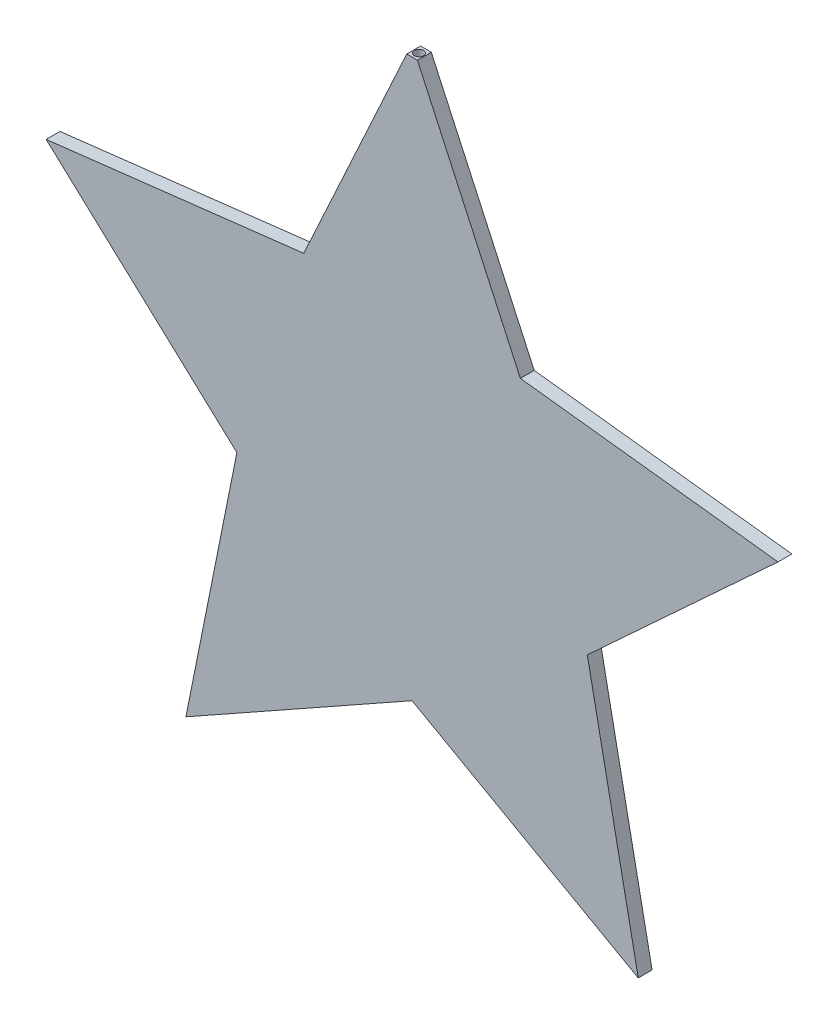
ISO-10303-21;
HEADER;
FILE_DESCRIPTION(('STEP AP214'),'2;1');
FILE_NAME('part.step','',(''),(''),'','','');
FILE_SCHEMA(('AUTOMOTIVE_DESIGN { 1 0 10303 214 1 1 1 1 }'));
ENDSEC;
DATA;
#1=APPLICATION_CONTEXT('core data for automotive mechanical design processes');
#2=APPLICATION_PROTOCOL_DEFINITION('international standard','automotive_design',2000,#1);
#3=PRODUCT_CONTEXT('',#1,'mechanical');
#4=PRODUCT('Part','Part','',(#3));
#5=PRODUCT_RELATED_PRODUCT_CATEGORY('part','',(#4));
#6=PRODUCT_DEFINITION_FORMATION('','',#4);
#7=PRODUCT_DEFINITION_CONTEXT('part definition',#1,'design');
#8=PRODUCT_DEFINITION('design','',#6,#7);
#9=PRODUCT_DEFINITION_SHAPE('','',#8);
#10=(LENGTH_UNIT() NAMED_UNIT(*) SI_UNIT(.MILLI.,.METRE.));
#11=(NAMED_UNIT(*) PLANE_ANGLE_UNIT() SI_UNIT($,.RADIAN.));
#12=(NAMED_UNIT(*) SI_UNIT($,.STERADIAN.) SOLID_ANGLE_UNIT());
#13=UNCERTAINTY_MEASURE_WITH_UNIT(LENGTH_MEASURE(1.E-05),#10,'distance_accuracy_value','');
#14=(GEOMETRIC_REPRESENTATION_CONTEXT(3) GLOBAL_UNCERTAINTY_ASSIGNED_CONTEXT((#13)) GLOBAL_UNIT_ASSIGNED_CONTEXT((#10,
#11,#12)) REPRESENTATION_CONTEXT('',''));
#15=CARTESIAN_POINT('',(0.,0.,0.));
#16=DIRECTION('',(0.,0.,1.));
#17=DIRECTION('',(1.,0.,0.));
#18=AXIS2_PLACEMENT_3D('',#15,#16,#17);
#19=CARTESIAN_POINT('',(-23.4822401036244,99.8205307307917,1.5));
#20=DIRECTION('',(0.116227999491727,-0.99322255921528,0.));
#21=DIRECTION('',(0.99322255921528,0.116227999491727,0.));
#22=AXIS2_PLACEMENT_3D('',#19,#20,#21);
#23=PLANE('',#22);
#24=DIRECTION('',(-0.99322255921528,-0.116227999491727,0.));
#25=VECTOR('',#24,1.);
#26=CARTESIAN_POINT('',(-23.4822401036244,99.8205307307917,-1.5));
#27=LINE('',#26,#25);
#28=CARTESIAN_POINT('',(-23.4822401036244,99.8205307307917,-1.5));
#29=VERTEX_POINT('',#28);
#30=CARTESIAN_POINT('',(-79.3510090594839,93.2827057593821,-1.5));
#31=VERTEX_POINT('',#30);
#32=EDGE_CURVE('E139',#29,#31,#27,.T.);
#33=ORIENTED_EDGE('',*,*,#32,.T.);
#34=DIRECTION('',(0.,0.,-1.));
#35=VECTOR('',#34,1.);
#36=CARTESIAN_POINT('',(-79.3510090594839,93.2827057593821,1.5));
#37=LINE('',#36,#35);
#38=CARTESIAN_POINT('',(-79.3510090594839,93.2827057593821,1.5));
#39=VERTEX_POINT('',#38);
#40=EDGE_CURVE('E11',#39,#31,#37,.T.);
#41=ORIENTED_EDGE('',*,*,#40,.F.);
#42=DIRECTION('',(-0.99322255921528,-0.116227999491727,0.));
#43=VECTOR('',#42,1.);
#44=CARTESIAN_POINT('',(-23.4822401036244,99.8205307307917,1.5));
#45=LINE('',#44,#43);
#46=CARTESIAN_POINT('',(-23.4822401036244,99.8205307307917,1.5));
#47=VERTEX_POINT('',#46);
#48=EDGE_CURVE('E140',#47,#39,#45,.T.);
#49=ORIENTED_EDGE('',*,*,#48,.F.);
#50=DIRECTION('',(0.,0.,-1.));
#51=VECTOR('',#50,1.);
#52=CARTESIAN_POINT('',(-23.4822401036244,99.8205307307917,1.5));
#53=LINE('',#52,#51);
#54=EDGE_CURVE('E150',#47,#29,#53,.T.);
#55=ORIENTED_EDGE('',*,*,#54,.T.);
#56=EDGE_LOOP('',(#33,#41,#49,#55));
#57=FACE_BOUND('',#56,.T.);
#58=ADVANCED_FACE('F32',(#57),#23,.F.);
#59=CARTESIAN_POINT('',(-79.3510090594839,93.2827057593821,1.5));
#60=DIRECTION('',(0.677831999361938,0.735216825597046,0.));
#61=DIRECTION('',(-0.735216825597046,0.677831999361938,0.));
#62=AXIS2_PLACEMENT_3D('',#59,#60,#61);
#63=PLANE('',#62);
#64=DIRECTION('',(0.735216825597046,-0.677831999361938,0.));
#65=VECTOR('',#64,1.);
#66=CARTESIAN_POINT('',(-79.3510090594839,93.2827057593821,-1.5));
#67=LINE('',#66,#65);
#68=CARTESIAN_POINT('',(-37.9950626196501,55.1546557952731,-1.5));
#69=VERTEX_POINT('',#68);
#70=EDGE_CURVE('E182',#31,#69,#67,.T.);
#71=ORIENTED_EDGE('',*,*,#70,.T.);
#72=DIRECTION('',(0.,0.,-1.));
#73=VECTOR('',#72,1.);
#74=CARTESIAN_POINT('',(-37.9950626196501,55.1546557952731,1.5));
#75=LINE('',#74,#73);
#76=CARTESIAN_POINT('',(-37.9950626196501,55.1546557952731,1.5));
#77=VERTEX_POINT('',#76);
#78=EDGE_CURVE('E40',#77,#69,#75,.T.);
#79=ORIENTED_EDGE('',*,*,#78,.F.);
#80=DIRECTION('',(0.735216825597046,-0.677831999361938,0.));
#81=VECTOR('',#80,1.);
#82=CARTESIAN_POINT('',(-79.3510090594839,93.2827057593821,1.5));
#83=LINE('',#82,#81);
#84=EDGE_CURVE('E144',#39,#77,#83,.T.);
#85=ORIENTED_EDGE('',*,*,#84,.F.);
#86=ORIENTED_EDGE('',*,*,#40,.T.);
#87=EDGE_LOOP('',(#71,#79,#85,#86));
#88=FACE_BOUND('',#87,.T.);
#89=ADVANCED_FACE('F249',(#88),#63,.F.);
#90=CARTESIAN_POINT('',(-37.9950626196501,55.1546557952731,1.5));
#91=DIRECTION('',(0.980527214138188,-0.196383253701543,0.));
#92=DIRECTION('',(0.196383253701543,0.980527214138188,0.));
#93=AXIS2_PLACEMENT_3D('',#90,#91,#92);
#94=PLANE('',#93);
#95=DIRECTION('',(-0.196383253701543,-0.980527214138188,0.));
#96=VECTOR('',#95,1.);
#97=CARTESIAN_POINT('',(-37.9950626196501,55.1546557952731,-1.5));
#98=LINE('',#97,#96);
#99=CARTESIAN_POINT('',(-49.0416206403618,0.,-1.5));
#100=VERTEX_POINT('',#99);
#101=EDGE_CURVE('E178',#69,#100,#98,.T.);
#102=ORIENTED_EDGE('',*,*,#101,.T.);
#103=DIRECTION('',(0.,0.,-1.));
#104=VECTOR('',#103,1.);
#105=CARTESIAN_POINT('',(-49.0416206403618,0.,1.5));
#106=LINE('',#105,#104);
#107=CARTESIAN_POINT('',(-49.0416206403618,0.,1.5));
#108=VERTEX_POINT('',#107);
#109=EDGE_CURVE('E168',#108,#100,#106,.T.);
#110=ORIENTED_EDGE('',*,*,#109,.F.);
#111=DIRECTION('',(-0.196383253701543,-0.980527214138188,0.));
#112=VECTOR('',#111,1.);
#113=CARTESIAN_POINT('',(-37.9950626196501,55.1546557952731,1.5));
#114=LINE('',#113,#112);
#115=EDGE_CURVE('E179',#77,#108,#114,.T.);
#116=ORIENTED_EDGE('',*,*,#115,.F.);
#117=ORIENTED_EDGE('',*,*,#78,.T.);
#118=EDGE_LOOP('',(#102,#110,#116,#117));
#119=FACE_BOUND('',#118,.T.);
#120=ADVANCED_FACE('F176',(#119),#94,.F.);
#121=CARTESIAN_POINT('',(-49.0416206403618,0.,1.5));
#122=DIRECTION('',(-0.489771145739921,0.871851033606433,0.));
#123=DIRECTION('',(-0.871851033606433,-0.489771145739921,0.));
#124=AXIS2_PLACEMENT_3D('',#121,#122,#123);
#125=PLANE('',#124);
#126=CARTESIAN_POINT('',(0.,27.5496269478705,0.));
#127=DIRECTION('',(-0.489771145739921,0.871851033606433,0.));
#128=DIRECTION('',(-0.871851033606433,-0.489771145739921,0.));
#129=AXIS2_PLACEMENT_3D('',#126,#127,#128);
#130=ELLIPSE('',#129,1.14698493372598,1.);
#131=CARTESIAN_POINT('',(0.,27.5496269478705,1.));
#132=VERTEX_POINT('',#131);
#133=CARTESIAN_POINT('',(0.,27.5496269478705,-1.));
#134=VERTEX_POINT('',#133);
#135=EDGE_CURVE('E54',#132,#134,#130,.F.);
#136=ORIENTED_EDGE('',*,*,#135,.F.);
#137=DIRECTION('',(0.,0.,-1.));
#138=VECTOR('',#137,1.);
#139=CARTESIAN_POINT('',(0.,27.5496269478705,1.5));
#140=LINE('',#139,#138);
#141=CARTESIAN_POINT('',(0.,27.5496269478705,1.5));
#142=VERTEX_POINT('',#141);
#143=EDGE_CURVE('E165',#142,#132,#140,.T.);
#144=ORIENTED_EDGE('',*,*,#143,.F.);
#145=DIRECTION('',(0.871851033606433,0.489771145739921,0.));
#146=VECTOR('',#145,1.);
#147=CARTESIAN_POINT('',(-49.0416206403618,0.,1.5));
#148=LINE('',#147,#146);
#149=EDGE_CURVE('E225',#108,#142,#148,.T.);
#150=ORIENTED_EDGE('',*,*,#149,.F.);
#151=ORIENTED_EDGE('',*,*,#109,.T.);
#152=DIRECTION('',(0.871851033606433,0.489771145739921,0.));
#153=VECTOR('',#152,1.);
#154=CARTESIAN_POINT('',(-49.0416206403618,0.,-1.5));
#155=LINE('',#154,#153);
#156=CARTESIAN_POINT('',(0.,27.5496269478705,-1.5));
#157=VERTEX_POINT('',#156);
#158=EDGE_CURVE('E185',#100,#157,#155,.T.);
#159=ORIENTED_EDGE('',*,*,#158,.T.);
#160=EDGE_CURVE('E164',#134,#157,#140,.T.);
#161=ORIENTED_EDGE('',*,*,#160,.F.);
#162=EDGE_LOOP('',(#136,#144,#150,#151,#159,#161));
#163=FACE_BOUND('',#162,.T.);
#164=ADVANCED_FACE('F245',(#163),#125,.F.);
#165=CARTESIAN_POINT('',(0.,27.5496269478705,1.5));
#166=DIRECTION('',(0.489771145739921,0.871851033606433,0.));
#167=DIRECTION('',(-0.871851033606433,0.489771145739921,0.));
#168=AXIS2_PLACEMENT_3D('',#165,#166,#167);
#169=PLANE('',#168);
#170=CARTESIAN_POINT('',(0.,27.5496269478706,0.));
#171=DIRECTION('',(0.489771145739921,0.871851033606433,0.));
#172=DIRECTION('',(0.871851033606433,-0.489771145739921,0.));
#173=AXIS2_PLACEMENT_3D('',#170,#171,#172);
#174=ELLIPSE('',#173,1.14698493372598,1.);
#175=EDGE_CURVE('E217',#134,#132,#174,.F.);
#176=ORIENTED_EDGE('',*,*,#175,.F.);
#177=ORIENTED_EDGE('',*,*,#160,.T.);
#178=DIRECTION('',(0.871851033606433,-0.489771145739921,0.));
#179=VECTOR('',#178,1.);
#180=CARTESIAN_POINT('',(0.,27.5496269478705,-1.5));
#181=LINE('',#180,#179);
#182=CARTESIAN_POINT('',(49.0416206403618,0.,-1.5));
#183=VERTEX_POINT('',#182);
#184=EDGE_CURVE('E187',#157,#183,#181,.T.);
#185=ORIENTED_EDGE('',*,*,#184,.T.);
#186=DIRECTION('',(0.,0.,-1.));
#187=VECTOR('',#186,1.);
#188=CARTESIAN_POINT('',(49.0416206403618,0.,1.5));
#189=LINE('',#188,#187);
#190=CARTESIAN_POINT('',(49.0416206403618,0.,1.5));
#191=VERTEX_POINT('',#190);
#192=EDGE_CURVE('E161',#191,#183,#189,.T.);
#193=ORIENTED_EDGE('',*,*,#192,.F.);
#194=DIRECTION('',(0.871851033606433,-0.489771145739921,0.));
#195=VECTOR('',#194,1.);
#196=CARTESIAN_POINT('',(0.,27.5496269478705,1.5));
#197=LINE('',#196,#195);
#198=EDGE_CURVE('E227',#142,#191,#197,.T.);
#199=ORIENTED_EDGE('',*,*,#198,.F.);
#200=ORIENTED_EDGE('',*,*,#143,.T.);
#201=EDGE_LOOP('',(#176,#177,#185,#193,#199,#200));
#202=FACE_BOUND('',#201,.T.);
#203=ADVANCED_FACE('F242',(#202),#169,.F.);
#204=CARTESIAN_POINT('',(49.0416206403618,0.,1.5));
#205=DIRECTION('',(-0.980527214138188,-0.196383253701543,0.));
#206=DIRECTION('',(0.196383253701543,-0.980527214138188,0.));
#207=AXIS2_PLACEMENT_3D('',#204,#205,#206);
#208=PLANE('',#207);
#209=DIRECTION('',(-0.196383253701543,0.980527214138188,0.));
#210=VECTOR('',#209,1.);
#211=CARTESIAN_POINT('',(49.0416206403618,0.,-1.5));
#212=LINE('',#211,#210);
#213=CARTESIAN_POINT('',(37.9950626196501,55.1546557952731,-1.5));
#214=VERTEX_POINT('',#213);
#215=EDGE_CURVE('E193',#183,#214,#212,.T.);
#216=ORIENTED_EDGE('',*,*,#215,.T.);
#217=DIRECTION('',(0.,0.,-1.));
#218=VECTOR('',#217,1.);
#219=CARTESIAN_POINT('',(37.9950626196501,55.1546557952731,1.5));
#220=LINE('',#219,#218);
#221=CARTESIAN_POINT('',(37.9950626196501,55.1546557952731,1.5));
#222=VERTEX_POINT('',#221);
#223=EDGE_CURVE('E158',#222,#214,#220,.T.);
#224=ORIENTED_EDGE('',*,*,#223,.F.);
#225=DIRECTION('',(-0.196383253701543,0.980527214138188,0.));
#226=VECTOR('',#225,1.);
#227=CARTESIAN_POINT('',(49.0416206403618,0.,1.5));
#228=LINE('',#227,#226);
#229=EDGE_CURVE('E229',#191,#222,#228,.T.);
#230=ORIENTED_EDGE('',*,*,#229,.F.);
#231=ORIENTED_EDGE('',*,*,#192,.T.);
#232=EDGE_LOOP('',(#216,#224,#230,#231));
#233=FACE_BOUND('',#232,.T.);
#234=ADVANCED_FACE('F238',(#233),#208,.F.);
#235=CARTESIAN_POINT('',(37.9950626196501,55.1546557952731,1.5));
#236=DIRECTION('',(-0.677831999361938,0.735216825597046,0.));
#237=DIRECTION('',(-0.735216825597046,-0.677831999361938,0.));
#238=AXIS2_PLACEMENT_3D('',#235,#236,#237);
#239=PLANE('',#238);
#240=DIRECTION('',(0.735216825597046,0.677831999361938,0.));
#241=VECTOR('',#240,1.);
#242=CARTESIAN_POINT('',(37.9950626196501,55.1546557952731,-1.5));
#243=LINE('',#242,#241);
#244=CARTESIAN_POINT('',(79.3510090594839,93.2827057593821,-1.5));
#245=VERTEX_POINT('',#244);
#246=EDGE_CURVE('E195',#214,#245,#243,.T.);
#247=ORIENTED_EDGE('',*,*,#246,.T.);
#248=DIRECTION('',(0.,0.,-1.));
#249=VECTOR('',#248,1.);
#250=CARTESIAN_POINT('',(79.3510090594839,93.2827057593821,1.5));
#251=LINE('',#250,#249);
#252=CARTESIAN_POINT('',(79.3510090594839,93.2827057593821,1.5));
#253=VERTEX_POINT('',#252);
#254=EDGE_CURVE('E155',#253,#245,#251,.T.);
#255=ORIENTED_EDGE('',*,*,#254,.F.);
#256=DIRECTION('',(0.735216825597046,0.677831999361938,0.));
#257=VECTOR('',#256,1.);
#258=CARTESIAN_POINT('',(37.9950626196501,55.1546557952731,1.5));
#259=LINE('',#258,#257);
#260=EDGE_CURVE('E212',#222,#253,#259,.T.);
#261=ORIENTED_EDGE('',*,*,#260,.F.);
#262=ORIENTED_EDGE('',*,*,#223,.T.);
#263=EDGE_LOOP('',(#247,#255,#261,#262));
#264=FACE_BOUND('',#263,.T.);
#265=ADVANCED_FACE('F235',(#264),#239,.F.);
#266=CARTESIAN_POINT('',(79.3510090594839,93.2827057593821,1.5));
#267=DIRECTION('',(-0.116227999491727,-0.99322255921528,0.));
#268=DIRECTION('',(0.99322255921528,-0.116227999491727,0.));
#269=AXIS2_PLACEMENT_3D('',#266,#267,#268);
#270=PLANE('',#269);
#271=DIRECTION('',(-0.99322255921528,0.116227999491727,0.));
#272=VECTOR('',#271,1.);
#273=CARTESIAN_POINT('',(79.3510090594839,93.2827057593821,-1.5));
#274=LINE('',#273,#272);
#275=CARTESIAN_POINT('',(23.4822401036244,99.8205307307917,-1.5));
#276=VERTEX_POINT('',#275);
#277=EDGE_CURVE('E146',#245,#276,#274,.T.);
#278=ORIENTED_EDGE('',*,*,#277,.T.);
#279=DIRECTION('',(0.,0.,-1.));
#280=VECTOR('',#279,1.);
#281=CARTESIAN_POINT('',(23.4822401036244,99.8205307307917,1.5));
#282=LINE('',#281,#280);
#283=CARTESIAN_POINT('',(23.4822401036244,99.8205307307917,1.5));
#284=VERTEX_POINT('',#283);
#285=EDGE_CURVE('E152',#284,#276,#282,.T.);
#286=ORIENTED_EDGE('',*,*,#285,.F.);
#287=DIRECTION('',(-0.99322255921528,0.116227999491727,0.));
#288=VECTOR('',#287,1.);
#289=CARTESIAN_POINT('',(79.3510090594839,93.2827057593821,1.5));
#290=LINE('',#289,#288);
#291=EDGE_CURVE('E209',#253,#284,#290,.T.);
#292=ORIENTED_EDGE('',*,*,#291,.F.);
#293=ORIENTED_EDGE('',*,*,#254,.T.);
#294=EDGE_LOOP('',(#278,#286,#292,#293));
#295=FACE_BOUND('',#294,.T.);
#296=ADVANCED_FACE('F199',(#295),#270,.F.);
#297=CARTESIAN_POINT('',(23.4822401036244,99.8205307307917,1.5));
#298=DIRECTION('',(-0.908694360007895,-0.417462046286656,0.));
#299=DIRECTION('',(0.417462046286656,-0.908694360007895,0.));
#300=AXIS2_PLACEMENT_3D('',#297,#298,#299);
#301=PLANE('',#300);
#302=DIRECTION('',(-0.417462046286656,0.908694360007895,0.));
#303=VECTOR('',#302,1.);
#304=CARTESIAN_POINT('',(23.4822401036244,99.8205307307917,-1.5));
#305=LINE('',#304,#303);
#306=CARTESIAN_POINT('',(1.15711111812964,148.415891616935,-1.5));
#307=VERTEX_POINT('',#306);
#308=EDGE_CURVE('E141',#276,#307,#305,.T.);
#309=ORIENTED_EDGE('',*,*,#308,.T.);
#310=DIRECTION('',(0.,0.,1.));
#311=VECTOR('',#310,1.);
#312=CARTESIAN_POINT('',(1.15711111812964,148.415891616935,1.5));
#313=LINE('',#312,#311);
#314=CARTESIAN_POINT('',(1.15711111812964,148.415891616935,1.5));
#315=VERTEX_POINT('',#314);
#316=EDGE_CURVE('E47',#307,#315,#313,.T.);
#317=ORIENTED_EDGE('',*,*,#316,.T.);
#318=DIRECTION('',(-0.417462046286656,0.908694360007895,0.));
#319=VECTOR('',#318,1.);
#320=CARTESIAN_POINT('',(23.4822401036244,99.8205307307917,1.5));
#321=LINE('',#320,#319);
#322=EDGE_CURVE('E207',#284,#315,#321,.T.);
#323=ORIENTED_EDGE('',*,*,#322,.F.);
#324=ORIENTED_EDGE('',*,*,#285,.T.);
#325=EDGE_LOOP('',(#309,#317,#323,#324));
#326=FACE_BOUND('',#325,.T.);
#327=ADVANCED_FACE('F205',(#326),#301,.F.);
#328=CARTESIAN_POINT('',(0.,150.934588481236,1.5));
#329=DIRECTION('',(0.908694360007895,-0.417462046286655,0.));
#330=DIRECTION('',(0.417462046286655,0.908694360007895,0.));
#331=AXIS2_PLACEMENT_3D('',#328,#329,#330);
#332=PLANE('',#331);
#333=DIRECTION('',(-0.417462046286655,-0.908694360007895,0.));
#334=VECTOR('',#333,1.);
#335=CARTESIAN_POINT('',(0.,150.934588481236,1.5));
#336=LINE('',#335,#334);
#337=CARTESIAN_POINT('',(-1.15711111812964,148.415891616935,1.5));
#338=VERTEX_POINT('',#337);
#339=EDGE_CURVE('E134',#338,#47,#336,.T.);
#340=ORIENTED_EDGE('',*,*,#339,.F.);
#341=DIRECTION('',(0.,0.,-1.));
#342=VECTOR('',#341,1.);
#343=CARTESIAN_POINT('',(-1.15711111812964,148.415891616935,1.5));
#344=LINE('',#343,#342);
#345=CARTESIAN_POINT('',(-1.15711111812964,148.415891616935,-1.5));
#346=VERTEX_POINT('',#345);
#347=EDGE_CURVE('E121',#338,#346,#344,.T.);
#348=ORIENTED_EDGE('',*,*,#347,.T.);
#349=DIRECTION('',(-0.417462046286655,-0.908694360007895,0.));
#350=VECTOR('',#349,1.);
#351=CARTESIAN_POINT('',(0.,150.934588481236,-1.5));
#352=LINE('',#351,#350);
#353=EDGE_CURVE('E132',#346,#29,#352,.T.);
#354=ORIENTED_EDGE('',*,*,#353,.T.);
#355=ORIENTED_EDGE('',*,*,#54,.F.);
#356=EDGE_LOOP('',(#340,#348,#354,#355));
#357=FACE_BOUND('',#356,.T.);
#358=ADVANCED_FACE('F130',(#357),#332,.F.);
#359=CARTESIAN_POINT('',(0.,0.,1.5));
#360=DIRECTION('',(0.,0.,-1.));
#361=DIRECTION('',(-1.,0.,0.));
#362=AXIS2_PLACEMENT_3D('',#359,#360,#361);
#363=PLANE('',#362);
#364=ORIENTED_EDGE('',*,*,#322,.T.);
#365=DIRECTION('',(-1.,0.,0.));
#366=VECTOR('',#365,1.);
#367=CARTESIAN_POINT('',(0.,148.415891616935,1.5));
#368=LINE('',#367,#366);
#369=EDGE_CURVE('E219',#315,#338,#368,.T.);
#370=ORIENTED_EDGE('',*,*,#369,.T.);
#371=ORIENTED_EDGE('',*,*,#339,.T.);
#372=ORIENTED_EDGE('',*,*,#48,.T.);
#373=ORIENTED_EDGE('',*,*,#84,.T.);
#374=ORIENTED_EDGE('',*,*,#115,.T.);
#375=ORIENTED_EDGE('',*,*,#149,.T.);
#376=ORIENTED_EDGE('',*,*,#198,.T.);
#377=ORIENTED_EDGE('',*,*,#229,.T.);
#378=ORIENTED_EDGE('',*,*,#260,.T.);
#379=ORIENTED_EDGE('',*,*,#291,.T.);
#380=EDGE_LOOP('',(#364,#370,#371,#372,#373,#374,#375,#376,#377,#378,#379));
#381=FACE_BOUND('',#380,.T.);
#382=ADVANCED_FACE('F231',(#381),#363,.F.);
#383=CARTESIAN_POINT('',(0.,0.,-1.5));
#384=DIRECTION('',(0.,0.,-1.));
#385=DIRECTION('',(-1.,0.,0.));
#386=AXIS2_PLACEMENT_3D('',#383,#384,#385);
#387=PLANE('',#386);
#388=DIRECTION('',(-1.,0.,0.));
#389=VECTOR('',#388,1.);
#390=CARTESIAN_POINT('',(0.,148.415891616935,-1.5));
#391=LINE('',#390,#389);
#392=EDGE_CURVE('E118',#307,#346,#391,.T.);
#393=ORIENTED_EDGE('',*,*,#392,.F.);
#394=ORIENTED_EDGE('',*,*,#308,.F.);
#395=ORIENTED_EDGE('',*,*,#277,.F.);
#396=ORIENTED_EDGE('',*,*,#246,.F.);
#397=ORIENTED_EDGE('',*,*,#215,.F.);
#398=ORIENTED_EDGE('',*,*,#184,.F.);
#399=ORIENTED_EDGE('',*,*,#158,.F.);
#400=ORIENTED_EDGE('',*,*,#101,.F.);
#401=ORIENTED_EDGE('',*,*,#70,.F.);
#402=ORIENTED_EDGE('',*,*,#32,.F.);
#403=ORIENTED_EDGE('',*,*,#353,.F.);
#404=EDGE_LOOP('',(#393,#394,#395,#396,#397,#398,#399,#400,#401,#402,#403));
#405=FACE_BOUND('',#404,.T.);
#406=ADVANCED_FACE('F137',(#405),#387,.T.);
#407=CARTESIAN_POINT('',(0.,217.,0.));
#408=DIRECTION('',(0.,-1.,0.));
#409=DIRECTION('',(0.,0.,-1.));
#410=AXIS2_PLACEMENT_3D('',#407,#408,#409);
#411=CYLINDRICAL_SURFACE('',#410,1.);
#412=CARTESIAN_POINT('',(0.,148.415891616935,0.));
#413=DIRECTION('',(0.,-1.,0.));
#414=DIRECTION('',(0.,0.,-1.));
#415=AXIS2_PLACEMENT_3D('',#412,#413,#414);
#416=CIRCLE('',#415,1.);
#417=CARTESIAN_POINT('',(0.,148.415891616935,-1.));
#418=VERTEX_POINT('',#417);
#419=EDGE_CURVE('E35',#418,#418,#416,.T.);
#420=ORIENTED_EDGE('',*,*,#419,.F.);
#421=EDGE_LOOP('',(#420));
#422=FACE_BOUND('',#421,.T.);
#423=ORIENTED_EDGE('',*,*,#135,.T.);
#424=ORIENTED_EDGE('',*,*,#175,.T.);
#425=EDGE_LOOP('',(#423,#424));
#426=FACE_BOUND('',#425,.T.);
#427=ADVANCED_FACE('F275',(#422,#426),#411,.F.);
#428=CARTESIAN_POINT('',(-1.63484519187834,148.415891616935,-5.));
#429=DIRECTION('',(0.,-1.,0.));
#430=DIRECTION('',(0.,0.,-1.));
#431=AXIS2_PLACEMENT_3D('',#428,#429,#430);
#432=PLANE('',#431);
#433=ORIENTED_EDGE('',*,*,#419,.T.);
#434=EDGE_LOOP('',(#433));
#435=FACE_BOUND('',#434,.T.);
#436=ORIENTED_EDGE('',*,*,#316,.F.);
#437=ORIENTED_EDGE('',*,*,#392,.T.);
#438=ORIENTED_EDGE('',*,*,#347,.F.);
#439=ORIENTED_EDGE('',*,*,#369,.F.);
#440=EDGE_LOOP('',(#436,#437,#438,#439));
#441=FACE_BOUND('',#440,.T.);
#442=ADVANCED_FACE('F120',(#435,#441),#432,.F.);
#443=CLOSED_SHELL('',(#58,#89,#120,#164,#203,#234,#265,#296,#327,#358,#382,#406,#427,#442));
#444=MANIFOLD_SOLID_BREP('B2',#443);
#445=ADVANCED_BREP_SHAPE_REPRESENTATION('',(#18,#444),#14);
#446=SHAPE_DEFINITION_REPRESENTATION(#9,#445);
ENDSEC;
END-ISO-10303-21;
